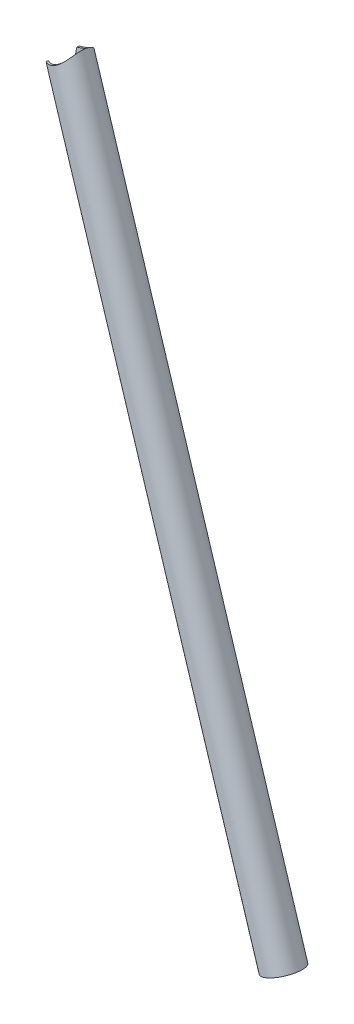
ISO-10303-21;
HEADER;
FILE_DESCRIPTION(('STEP AP214'),'2;1');
FILE_NAME('part.step','',(''),(''),'','','');
FILE_SCHEMA(('AUTOMOTIVE_DESIGN { 1 0 10303 214 1 1 1 1 }'));
ENDSEC;
DATA;
#1=APPLICATION_CONTEXT('core data for automotive mechanical design processes');
#2=APPLICATION_PROTOCOL_DEFINITION('international standard','automotive_design',2000,#1);
#3=PRODUCT_CONTEXT('',#1,'mechanical');
#4=PRODUCT('Part','Part','',(#3));
#5=PRODUCT_RELATED_PRODUCT_CATEGORY('part','',(#4));
#6=PRODUCT_DEFINITION_FORMATION('','',#4);
#7=PRODUCT_DEFINITION_CONTEXT('part definition',#1,'design');
#8=PRODUCT_DEFINITION('design','',#6,#7);
#9=PRODUCT_DEFINITION_SHAPE('','',#8);
#10=(LENGTH_UNIT() NAMED_UNIT(*) SI_UNIT(.MILLI.,.METRE.));
#11=(NAMED_UNIT(*) PLANE_ANGLE_UNIT() SI_UNIT($,.RADIAN.));
#12=(NAMED_UNIT(*) SI_UNIT($,.STERADIAN.) SOLID_ANGLE_UNIT());
#13=UNCERTAINTY_MEASURE_WITH_UNIT(LENGTH_MEASURE(1.E-05),#10,'distance_accuracy_value','');
#14=(GEOMETRIC_REPRESENTATION_CONTEXT(3) GLOBAL_UNCERTAINTY_ASSIGNED_CONTEXT((#13)) GLOBAL_UNIT_ASSIGNED_CONTEXT((#10,
#11,#12)) REPRESENTATION_CONTEXT('',''));
#15=CARTESIAN_POINT('',(0.,0.,0.));
#16=DIRECTION('',(0.,0.,1.));
#17=DIRECTION('',(1.,0.,0.));
#18=AXIS2_PLACEMENT_3D('',#15,#16,#17);
#19=CARTESIAN_POINT('',(-0.475660045373399,524.183761382044,114.597216694036));
#20=DIRECTION('',(-0.0599256750075872,0.0388990717535077,0.997444622869661));
#21=DIRECTION('',(-0.732310027678345,-0.680747809489739,-0.0174483018275184));
#22=AXIS2_PLACEMENT_3D('',#19,#20,#21);
#23=CYLINDRICAL_SURFACE('',#22,11.1125);
#24=CARTESIAN_POINT('',(10.2341303943395,519.556049376738,107.13314314926));
#25=CARTESIAN_POINT('',(10.2274072117825,519.573100332418,107.314965218978));
#26=CARTESIAN_POINT('',(10.217147495631,519.581911336864,107.497503596553));
#27=CARTESIAN_POINT('',(10.1896538638208,519.582872489982,107.862184967526));
#28=CARTESIAN_POINT('',(10.172414933988,519.575010642896,108.044327581803));
#29=CARTESIAN_POINT('',(10.1310443711813,519.543174120642,108.406828407419));
#30=CARTESIAN_POINT('',(10.1068970689237,519.519162646377,108.587181586754));
#31=CARTESIAN_POINT('',(10.0518550196694,519.456214461605,108.944252514454));
#32=CARTESIAN_POINT('',(10.0209565952736,519.417269607985,109.120968223825));
#33=CARTESIAN_POINT('',(9.91909959923639,519.281475935115,109.639728696333));
#34=CARTESIAN_POINT('',(9.83846253316572,519.165199254636,109.974913811905));
#35=CARTESIAN_POINT('',(9.6514691814672,518.894014049779,110.621253297568));
#36=CARTESIAN_POINT('',(9.54509706134565,518.739081739179,110.93239271649));
#37=CARTESIAN_POINT('',(9.34051081738401,518.450992682181,111.442640685805));
#38=CARTESIAN_POINT('',(9.24878846216203,518.324438580501,111.648183754764));
#39=CARTESIAN_POINT('',(9.05151799896422,518.061095013442,112.045750049925));
#40=CARTESIAN_POINT('',(8.94596542544548,517.924302248315,112.237768878458));
#41=CARTESIAN_POINT('',(8.72040709027281,517.643312205219,112.607877700326));
#42=CARTESIAN_POINT('',(8.60038073665043,517.499104549272,112.785947239759));
#43=CARTESIAN_POINT('',(8.34549137645246,517.206116965066,113.127048694065));
#44=CARTESIAN_POINT('',(8.21063009397951,517.057337569575,113.290082352356));
#45=CARTESIAN_POINT('',(7.92485533927849,516.75685628955,113.600893131238));
#46=CARTESIAN_POINT('',(7.77386056846067,516.605143094095,113.748584800673));
#47=CARTESIAN_POINT('',(7.45610250048303,516.301994742729,114.026360756286));
#48=CARTESIAN_POINT('',(7.28933755542274,516.150559617564,114.156443198932));
#49=CARTESIAN_POINT('',(6.9404603608249,515.850822091455,114.397066891145));
#50=CARTESIAN_POINT('',(6.75838387600943,515.702513349384,114.507651907774));
#51=CARTESIAN_POINT('',(6.37903305540815,515.411282149353,114.707799073185));
#52=CARTESIAN_POINT('',(6.18176519311311,515.268357435344,114.797370111514));
#53=CARTESIAN_POINT('',(5.82877955569832,515.028388699874,114.932376890613));
#54=CARTESIAN_POINT('',(5.67638208366133,514.929452491543,114.983188692357));
#55=CARTESIAN_POINT('',(5.36472506317856,514.736829174619,115.072076648534));
#56=CARTESIAN_POINT('',(5.20546701110686,514.643140931535,115.110155564443));
#57=CARTESIAN_POINT('',(4.88098021012821,514.462022743711,115.173005288141));
#58=CARTESIAN_POINT('',(4.71575449392061,514.374589685664,115.197782756778));
#59=CARTESIAN_POINT('',(4.38027288138449,514.206819065646,115.23364268118));
#60=CARTESIAN_POINT('',(4.21001681390169,514.126481745475,115.244724670416));
#61=CARTESIAN_POINT('',(3.86529205265225,513.973506100937,115.25296874534));
#62=CARTESIAN_POINT('',(3.69081483432062,513.900885291373,115.250099827241));
#63=CARTESIAN_POINT('',(3.33933866029077,513.76415308406,115.23035272871));
#64=CARTESIAN_POINT('',(3.16233971400731,513.700041654552,115.213474600568));
#65=CARTESIAN_POINT('',(2.80716968054416,513.580720861931,115.165907293643));
#66=CARTESIAN_POINT('',(2.62899838098968,513.525513160695,115.135215540598));
#67=CARTESIAN_POINT('',(2.27289102468856,513.424202505232,115.060425592442));
#68=CARTESIAN_POINT('',(2.09495496717308,513.378099521174,115.016327441257));
#69=CARTESIAN_POINT('',(1.74580106188308,513.296188052865,114.916772870867));
#70=CARTESIAN_POINT('',(1.57453871145066,513.260118374425,114.86168553708));
#71=CARTESIAN_POINT('',(1.23450294724859,513.196328566987,114.740024743629));
#72=CARTESIAN_POINT('',(1.06573042547763,513.1686113644,114.673447271045));
#73=CARTESIAN_POINT('',(0.731746957375261,513.121209696467,114.5295222931));
#74=CARTESIAN_POINT('',(0.566535075553879,513.101523096254,114.452177657442));
#75=CARTESIAN_POINT('',(0.240444534504744,513.069703940657,114.28740384819));
#76=CARTESIAN_POINT('',(0.0795674722509791,513.0575741338,114.199971019047));
#77=CARTESIAN_POINT('',(-0.429754003328394,513.029871524286,113.903593727653));
#78=CARTESIAN_POINT('',(-0.768421976588896,513.028044844768,113.676163686224));
#79=CARTESIAN_POINT('',(-1.41452239493937,513.051992837081,113.181716656374));
#80=CARTESIAN_POINT('',(-1.72192338262479,513.077795011062,112.914660451655));
#81=CARTESIAN_POINT('',(-2.18221920858475,513.134416955797,112.46208290388));
#82=CARTESIAN_POINT('',(-2.34702829566076,513.158907131197,112.28768408927));
#83=CARTESIAN_POINT('',(-2.66282531291183,513.2129222477,111.927421055171));
#84=CARTESIAN_POINT('',(-2.81381051262176,513.242448180171,111.741554582697));
#85=CARTESIAN_POINT('',(-3.10069278605441,513.304560378944,111.35892835691));
#86=CARTESIAN_POINT('',(-3.23658752838108,513.337147116692,111.162166927402));
#87=CARTESIAN_POINT('',(-3.49169450253777,513.403160339882,110.758382399945));
#88=CARTESIAN_POINT('',(-3.61091116576239,513.436586599467,110.551362047683));
#89=CARTESIAN_POINT('',(-3.89328254533656,513.520380518163,110.007089887458));
#90=CARTESIAN_POINT('',(-4.04311416779491,513.569628647218,109.662447583355));
#91=CARTESIAN_POINT('',(-4.22677793942232,513.632496703588,109.130598112818));
#92=CARTESIAN_POINT('',(-4.28113163433348,513.651610537148,108.950946027161));
#93=CARTESIAN_POINT('',(-4.3749830692836,513.684816285076,108.587295408968));
#94=CARTESIAN_POINT('',(-4.41448355467281,513.698909127458,108.403297686335));
#95=CARTESIAN_POINT('',(-4.47265473249613,513.719153799665,108.060239400771));
#96=CARTESIAN_POINT('',(-4.49357026437961,513.72618347068,107.901609317209));
#97=CARTESIAN_POINT('',(-4.52322061415148,513.735096933993,107.583078597964));
#98=CARTESIAN_POINT('',(-4.53195774497786,513.736981703483,107.423178209343));
#99=CARTESIAN_POINT('',(-4.53688026160235,513.735218559291,107.10329509949));
#100=CARTESIAN_POINT('',(-4.53307245079007,513.731573645053,106.943312469914));
#101=CARTESIAN_POINT('',(-4.51284554028126,513.718660510578,106.624370285301));
#102=CARTESIAN_POINT('',(-4.49642610986406,513.709392142876,106.465410757203));
#103=CARTESIAN_POINT('',(-4.45126104064574,513.685468604504,106.149976516807));
#104=CARTESIAN_POINT('',(-4.42253841751851,513.67082349941,105.99349772778));
#105=CARTESIAN_POINT('',(-4.35329175473335,513.636634735789,105.683736567292));
#106=CARTESIAN_POINT('',(-4.3127677713199,513.617091100609,105.530454180602));
#107=CARTESIAN_POINT('',(-4.2205775792786,513.573775487583,105.227704982746));
#108=CARTESIAN_POINT('',(-4.16889820857593,513.549998520748,105.078242914123));
#109=CARTESIAN_POINT('',(-4.05523398016214,513.499049919579,104.783872513099));
#110=CARTESIAN_POINT('',(-3.99324649859177,513.471877421373,104.638965351314));
#111=CARTESIAN_POINT('',(-3.83276722936407,513.403490451262,104.296400759623));
#112=CARTESIAN_POINT('',(-3.72965769538993,513.361045368198,104.10114315699));
#113=CARTESIAN_POINT('',(-3.50692369786928,513.273568905556,103.720996867305));
#114=CARTESIAN_POINT('',(-3.38729936067065,513.228537545766,103.536108100941));
#115=CARTESIAN_POINT('',(-3.13313668638354,513.138005087593,103.176528588132));
#116=CARTESIAN_POINT('',(-2.99857231262977,513.092503298559,103.001856481648));
#117=CARTESIAN_POINT('',(-2.71623893171839,513.003108085996,102.663157775538));
#118=CARTESIAN_POINT('',(-2.56847126674365,512.959214499625,102.499130096772));
#119=CARTESIAN_POINT('',(-2.25690127896265,512.873711980385,102.177597271798));
#120=CARTESIAN_POINT('',(-2.09277874633396,512.832193889067,102.0203784255));
#121=CARTESIAN_POINT('',(-1.75300423607653,512.754501036428,101.717399306595));
#122=CARTESIAN_POINT('',(-1.57734893927496,512.718327823207,101.571642359525));
#123=CARTESIAN_POINT('',(-1.21574699319488,512.653022194708,101.292160439675));
#124=CARTESIAN_POINT('',(-1.02981065763395,512.623882875207,101.15842374985));
#125=CARTESIAN_POINT('',(-0.648483372154977,512.574157863867,100.903397298334));
#126=CARTESIAN_POINT('',(-0.453092791316318,512.55357183842,100.782107051329));
#127=CARTESIAN_POINT('',(-0.0675466143273456,512.523497877058,100.560565603574));
#128=CARTESIAN_POINT('',(0.122056415386738,512.513348498664,100.459443525601));
#129=CARTESIAN_POINT('',(0.507495605876689,512.502897747924,100.269453894657));
#130=CARTESIAN_POINT('',(0.703329085371902,512.502592195158,100.180581155674));
#131=CARTESIAN_POINT('',(1.10016107835525,512.512864593116,100.015888428465));
#132=CARTESIAN_POINT('',(1.30115967348481,512.523442715973,99.9400686467042));
#133=CARTESIAN_POINT('',(1.70696063690539,512.556396345449,99.8023865639658));
#134=CARTESIAN_POINT('',(1.91176298629878,512.578771793472,99.7405241936652));
#135=CARTESIAN_POINT('',(2.32520625443408,512.636268913058,99.6312204898819));
#136=CARTESIAN_POINT('',(2.53386471044798,512.671489766273,99.5838967979741));
#137=CARTESIAN_POINT('',(2.95156673790204,512.755121795286,99.5051592657375));
#138=CARTESIAN_POINT('',(3.16061031343804,512.803533112181,99.4737455956078));
#139=CARTESIAN_POINT('',(3.57687186890562,512.913633976981,99.4274852891521));
#140=CARTESIAN_POINT('',(3.7840911052842,512.975313496249,99.4126261923473));
#141=CARTESIAN_POINT('',(4.19471448402494,513.111713757701,99.3998072917349));
#142=CARTESIAN_POINT('',(4.39811914938704,513.18643269741,99.4018451540252));
#143=CARTESIAN_POINT('',(4.77234310442548,513.337477618081,99.4214566568617));
#144=CARTESIAN_POINT('',(4.94389805659461,513.412267992186,99.4369278661369));
#145=CARTESIAN_POINT('',(5.28133085412802,513.570505707208,99.4804206544552));
#146=CARTESIAN_POINT('',(5.4472087805626,513.653952924432,99.5084420541958));
#147=CARTESIAN_POINT('',(5.77217414116783,513.82868424282,99.5766871404416));
#148=CARTESIAN_POINT('',(5.93126161281632,513.919968300723,99.6169107595904));
#149=CARTESIAN_POINT('',(6.24174386927863,514.109433012722,99.7090680992979));
#150=CARTESIAN_POINT('',(6.39313838235479,514.207613910143,99.7610022331542));
#151=CARTESIAN_POINT('',(6.68616068945117,514.408911474504,99.875454607113));
#152=CARTESIAN_POINT('',(6.82786643169186,514.511973540804,99.9378695709405));
#153=CARTESIAN_POINT('',(7.10259155337179,514.722853870142,100.072987247444));
#154=CARTESIAN_POINT('',(7.23560807226988,514.830673680079,100.145693323316));
#155=CARTESIAN_POINT('',(7.62104021040224,515.159663632023,100.378249430149));
#156=CARTESIAN_POINT('',(7.86005118604512,515.386512692556,100.552621849205));
#157=CARTESIAN_POINT('',(8.33149021548269,515.878625910989,100.961267156772));
#158=CARTESIAN_POINT('',(8.55852684715895,516.144894032543,101.200474212741));
#159=CARTESIAN_POINT('',(8.96698988478807,516.675789068417,101.717501913532));
#160=CARTESIAN_POINT('',(9.1483492727932,516.940413021973,101.995378377651));
#161=CARTESIAN_POINT('',(9.40220225351772,517.35066733785,102.465252580887));
#162=CARTESIAN_POINT('',(9.48889738598124,517.500732640374,102.6459393355));
#163=CARTESIAN_POINT('',(9.64765435916807,517.793658094003,103.019356179307));
#164=CARTESIAN_POINT('',(9.71971235962315,517.936516346862,103.212089411772));
#165=CARTESIAN_POINT('',(9.84957312766494,518.211927996309,103.609225419299));
#166=CARTESIAN_POINT('',(9.90738279842578,518.344486361689,103.813622484002));
#167=CARTESIAN_POINT('',(10.0091407913996,518.595874061277,104.233947215154));
#168=CARTESIAN_POINT('',(10.0530960887492,518.714710284891,104.449869015112));
#169=CARTESIAN_POINT('',(10.1166382950002,518.902765917957,104.82862281537));
#170=CARTESIAN_POINT('',(10.139595752083,518.976386249183,104.988714919477));
#171=CARTESIAN_POINT('',(10.1786977969855,519.113066486238,105.314136268454));
#172=CARTESIAN_POINT('',(10.1948445423874,519.176129732648,105.479463836897));
#173=CARTESIAN_POINT('',(10.2203169051271,519.289889792675,105.8142222992));
#174=CARTESIAN_POINT('',(10.2296654576585,519.340627798664,105.98363738506));
#175=CARTESIAN_POINT('',(10.2416465276669,519.428471874124,106.32613498641));
#176=CARTESIAN_POINT('',(10.2442836932802,519.465587362951,106.499214879934));
#177=CARTESIAN_POINT('',(10.2432826379168,519.508294206217,106.749696803824));
#178=CARTESIAN_POINT('',(10.2423407030296,519.519871847071,106.826130206125));
#179=CARTESIAN_POINT('',(10.2391874121701,519.540142068033,106.97938060579));
#180=CARTESIAN_POINT('',(10.236975582846,519.548833570428,107.056197735598));
#181=CARTESIAN_POINT('',(10.2341303943395,519.556049376738,107.13314314926));
#182=B_SPLINE_CURVE_WITH_KNOTS('',3,(#24,#25,#26,#27,#28,#29,#30,#31,#32,#33,#34,#35,#36,#37,
#38,#39,#40,#41,#42,#43,#44,#45,#46,#47,#48,#49,#50,#51,#52,#53,#54,#55,#56,#57,#58,#59,#60,#61,
#62,#63,#64,#65,#66,#67,#68,#69,#70,#71,#72,#73,#74,#75,#76,#77,#78,#79,#80,#81,#82,#83,#84,#85,
#86,#87,#88,#89,#90,#91,#92,#93,#94,#95,#96,#97,#98,#99,#100,#101,#102,#103,#104,#105,#106,#107,
#108,#109,#110,#111,#112,#113,#114,#115,#116,#117,#118,#119,#120,#121,#122,#123,#124,#125,#126,
#127,#128,#129,#130,#131,#132,#133,#134,#135,#136,#137,#138,#139,#140,#141,#142,#143,#144,#145,
#146,#147,#148,#149,#150,#151,#152,#153,#154,#155,#156,#157,#158,#159,#160,#161,#162,#163,#164,
#165,#166,#167,#168,#169,#170,#171,#172,#173,#174,#175,#176,#177,#178,#179,#180,#181),
.UNSPECIFIED.,.T.,.F.,(4,2,2,2,2,2,2,2,2,2,2,2,2,2,2,2,2,2,2,2,2,2,2,2,2,2,2,2,2,2,2,2,2,2,2,2,
2,2,2,2,2,2,2,2,2,2,2,2,2,2,2,2,2,2,2,2,2,2,2,2,2,2,2,2,2,2,2,2,2,2,2,2,2,2,2,2,2,2,4),(0.,
0.548131685017418,1.09665787277749,1.64643820485618,2.196518757315,3.2831275482416,
4.37040662549944,5.1441740946513,5.91819201870665,6.69332443291498,7.46836685689005,
8.24751754832977,9.02674974708444,9.80420984614681,10.5813404606877,11.1467698004782,
11.7120764317163,12.2770997146501,12.8421422443048,13.4084410688968,13.9747377797962,
14.5411400676258,15.1075404996766,15.6574091879198,16.2074703072733,16.7573851020379,
17.3074997930231,18.5264904887493,19.7466957138546,20.469652674001,21.1927521244106,
21.9159631348981,22.6389816205128,23.771230623246,24.3366780369666,24.9020208864098,
25.3819848148533,25.8618575754886,26.3414701337328,26.8210952695216,27.2998270588399,
27.7785565665924,28.2578540380861,28.7372736987515,29.4108233649177,30.0843678783218,
30.7591052003001,31.4337740096043,32.12624449019,32.8189151474861,33.5109031132884,
34.2028640866922,34.8476080021122,35.4920781077808,36.1365584064167,36.781035504032,
37.4305978830646,38.0801672107017,38.7292472823167,39.3782377008703,39.9409073473895,
40.5035689553937,41.0662274575573,41.6289058206594,42.1863341143731,42.7439450013157,
43.8583565792215,45.1254976553122,46.3944871983125,47.1448916332729,47.8954926943727,
48.6457293786935,49.3955877425332,49.9282273546744,50.4606981036301,50.9913640044802,
51.5216622794491,51.7535400367568,51.9855042824093),.UNSPECIFIED.);
#183=CARTESIAN_POINT('',(0.845729685967278,512.506421026561,100.121684494328));
#184=VERTEX_POINT('',#183);
#185=CARTESIAN_POINT('',(0.00263960369813285,513.053689315165,114.154662329748));
#186=VERTEX_POINT('',#185);
#187=EDGE_CURVE('E83',#184,#186,#182,.T.);
#188=ORIENTED_EDGE('',*,*,#187,.F.);
#189=DIRECTION('',(-0.0599256750075872,0.0388990717535077,0.997444622869661));
#190=VECTOR('',#189,1.);
#191=CARTESIAN_POINT('',(-0.0514754005405243,513.088816552907,115.055390106074));
#192=LINE('',#191,#190);
#193=CARTESIAN_POINT('',(0.784542491362576,512.546138978391,101.140126726964));
#194=VERTEX_POINT('',#193);
#195=EDGE_CURVE('E77',#184,#194,#192,.T.);
#196=ORIENTED_EDGE('',*,*,#195,.T.);
#197=CARTESIAN_POINT('',(9.70428448517733,518.475961128007,107.180409164478));
#198=CARTESIAN_POINT('',(9.69852402599452,518.490585941782,107.350302365884));
#199=CARTESIAN_POINT('',(9.68884714249733,518.4982310049,107.520631659068));
#200=CARTESIAN_POINT('',(9.66174681752716,518.499503286333,107.860781957199));
#201=CARTESIAN_POINT('',(9.64432142780684,518.49312697759,108.030602823491));
#202=CARTESIAN_POINT('',(9.60183658965247,518.466746187641,108.368373854521));
#203=CARTESIAN_POINT('',(9.57676952416774,518.446728083892,108.536321978616));
#204=CARTESIAN_POINT('',(9.51915592951392,518.393902960578,108.868953469232));
#205=CARTESIAN_POINT('',(9.48660587379771,518.36108990598,109.033635256534));
#206=CARTESIAN_POINT('',(9.41448399485506,518.284155401581,109.357264060771));
#207=CARTESIAN_POINT('',(9.37497145691882,518.240128131366,109.516246835398));
#208=CARTESIAN_POINT('',(9.2888675096423,518.141925231741,109.829105180273));
#209=CARTESIAN_POINT('',(9.24227331027489,518.087745600546,109.982978708343));
#210=CARTESIAN_POINT('',(9.09202570386455,517.912012929089,110.435897080653));
#211=CARTESIAN_POINT('',(8.9778654903417,517.777218695848,110.726427873167));
#212=CARTESIAN_POINT('',(8.70618747819058,517.464657643365,111.314770610721));
#213=CARTESIAN_POINT('',(8.54509291253079,517.283663401642,111.609202214364));
#214=CARTESIAN_POINT('',(8.27683164536406,516.997705497105,112.02334347716));
#215=CARTESIAN_POINT('',(8.18290139736027,516.899903366229,112.156887983856));
#216=CARTESIAN_POINT('',(7.98597529629124,516.700726497281,112.414390983337));
#217=CARTESIAN_POINT('',(7.88297761145332,516.599351039829,112.538347529649));
#218=CARTESIAN_POINT('',(7.65007945963047,516.377415166248,112.795703660117));
#219=CARTESIAN_POINT('',(7.51854502201384,516.256450941933,112.927282742327));
#220=CARTESIAN_POINT('',(7.24307605200157,516.013477991662,113.175532938972));
#221=CARTESIAN_POINT('',(7.09914641571891,515.891469695111,113.292209894947));
#222=CARTESIAN_POINT('',(6.79897086467986,515.648314533129,113.509539084957));
#223=CARTESIAN_POINT('',(6.64272585534105,515.527167605084,113.61019249539));
#224=CARTESIAN_POINT('',(6.31831697593359,515.287706129889,113.794187712662));
#225=CARTESIAN_POINT('',(6.15015483145522,515.169391175978,113.877532019002));
#226=CARTESIAN_POINT('',(5.81502370943682,514.945813896566,114.020338161307));
#227=CARTESIAN_POINT('',(5.6488196371723,514.840221577125,114.081076529646));
#228=CARTESIAN_POINT('',(5.30771931034792,514.634753466488,114.185499029512));
#229=CARTESIAN_POINT('',(5.13282333990288,514.534877488671,114.229183718067));
#230=CARTESIAN_POINT('',(4.7758526258984,514.342451907358,114.298624117688));
#231=CARTESIAN_POINT('',(4.5937864566691,514.249893928799,114.324400594883));
#232=CARTESIAN_POINT('',(4.2239348529842,514.073319089809,114.357529746721));
#233=CARTESIAN_POINT('',(4.03615035192708,513.989300845053,114.364885412034));
#234=CARTESIAN_POINT('',(3.68523731225424,513.842768043616,114.361252625633));
#235=CARTESIAN_POINT('',(3.52263299805859,513.778918048703,114.352848998301));
#236=CARTESIAN_POINT('',(3.19592930406396,513.65864302955,114.322653307837));
#237=CARTESIAN_POINT('',(3.03182998642782,513.602217698082,114.300861798898));
#238=CARTESIAN_POINT('',(2.70344447742197,513.497093107185,114.244158102465));
#239=CARTESIAN_POINT('',(2.53915829835466,513.448393365775,114.209246733946));
#240=CARTESIAN_POINT('',(2.21164858848721,513.35881134238,114.126740961333));
#241=CARTESIAN_POINT('',(2.04842508549249,513.317929264161,114.079146226728));
#242=CARTESIAN_POINT('',(1.72892060747086,513.244967124713,113.973391426255));
#243=CARTESIAN_POINT('',(1.57257536886612,513.212666702382,113.915576714683));
#244=CARTESIAN_POINT('',(1.26298039391839,513.155111855459,113.789119406575));
#245=CARTESIAN_POINT('',(1.10973167974795,513.12985972339,113.720473298363));
#246=CARTESIAN_POINT('',(0.656093139874496,513.064196421156,113.499263508185));
#247=CARTESIAN_POINT('',(0.361571120532479,513.033825138313,113.331348082877));
#248=CARTESIAN_POINT('',(-0.236482110479328,512.993927596258,112.939455879444));
#249=CARTESIAN_POINT('',(-0.537448468208959,512.987057905747,112.711346825453));
#250=CARTESIAN_POINT('',(-1.10629947565531,512.994665273246,112.216729779439));
#251=CARTESIAN_POINT('',(-1.37414295334735,513.009168614694,111.950174872528));
#252=CARTESIAN_POINT('',(-1.76438786421146,513.042591483665,111.504457114132));
#253=CARTESIAN_POINT('',(-1.90013584866818,513.056996776036,111.336446324732));
#254=CARTESIAN_POINT('',(-2.15738091160013,513.088594053643,110.990086995496));
#255=CARTESIAN_POINT('',(-2.27887539294782,513.105786545378,110.811736580497));
#256=CARTESIAN_POINT('',(-2.61964140816113,513.158937188459,110.262487087379));
#257=CARTESIAN_POINT('',(-2.81574639947498,513.196527702524,109.876767615727));
#258=CARTESIAN_POINT('',(-3.09481958250314,513.253258518596,109.166978944238));
#259=CARTESIAN_POINT('',(-3.19346315152599,513.274655197558,108.849277538477));
#260=CARTESIAN_POINT('',(-3.30224978880484,513.296781358843,108.363812495905));
#261=CARTESIAN_POINT('',(-3.33197878048745,513.302495021095,108.200561985427));
#262=CARTESIAN_POINT('',(-3.37772572611929,513.309957542069,107.872021538686));
#263=CARTESIAN_POINT('',(-3.39374368811382,513.311706403118,107.70673160362));
#264=CARTESIAN_POINT('',(-3.41158978403247,513.31075912102,107.374515850324));
#265=CARTESIAN_POINT('',(-3.41334235653223,513.308039399634,107.20758600415));
#266=CARTESIAN_POINT('',(-3.40225763869407,513.297914425699,106.874350051432));
#267=CARTESIAN_POINT('',(-3.38942038017636,513.290509183369,106.708043943529));
#268=CARTESIAN_POINT('',(-3.34930171200665,513.271124931376,106.377386225035));
#269=CARTESIAN_POINT('',(-3.32201400009135,513.259143926726,106.213035499245));
#270=CARTESIAN_POINT('',(-3.25348632902298,513.231025006105,105.88764559627));
#271=CARTESIAN_POINT('',(-3.21224641605312,513.214887103894,105.726606408126));
#272=CARTESIAN_POINT('',(-3.11992879546742,513.180369158243,105.420061626706));
#273=CARTESIAN_POINT('',(-3.06974391944994,513.162225749008,105.274258724306));
#274=CARTESIAN_POINT('',(-2.95868850868236,513.123570700371,104.987081269528));
#275=CARTESIAN_POINT('',(-2.89781441333712,513.103058272626,104.845708211289));
#276=CARTESIAN_POINT('',(-2.70034063661447,513.039056877131,104.429094278118));
#277=CARTESIAN_POINT('',(-2.54884219482633,512.993085256175,104.161205673378));
#278=CARTESIAN_POINT('',(-2.18517194114654,512.893133255108,103.606629825929));
#279=CARTESIAN_POINT('',(-1.9671687506607,512.839049449503,103.323803753242));
#280=CARTESIAN_POINT('',(-1.61204671820642,512.763876303966,102.923655334881));
#281=CARTESIAN_POINT('',(-1.48887951656227,512.739794240791,102.794196165249));
#282=CARTESIAN_POINT('',(-1.23386932674284,512.694594236527,102.543480717771));
#283=CARTESIAN_POINT('',(-1.1020248949766,512.673476790488,102.422225811671));
#284=CARTESIAN_POINT('',(-0.803048711308197,512.631310385436,102.164635001193));
#285=CARTESIAN_POINT('',(-0.634162016973729,512.611133733879,102.030187796773));
#286=CARTESIAN_POINT('',(-0.286261482586749,512.578028231156,101.774211403674));
#287=CARTESIAN_POINT('',(-0.107250465108008,512.565097370787,101.652678641497));
#288=CARTESIAN_POINT('',(0.259653954114896,512.547950349292,101.423249052663));
#289=CARTESIAN_POINT('',(0.447544868871461,512.543731762748,101.315348438792));
#290=CARTESIAN_POINT('',(0.830882283512546,512.545376043955,101.114039932458));
#291=CARTESIAN_POINT('',(1.02632710915892,512.551236690144,101.020628851303));
#292=CARTESIAN_POINT('',(1.39063769269737,512.572370908978,100.863353519791));
#293=CARTESIAN_POINT('',(1.55859820418272,512.585940861551,100.797156196248));
#294=CARTESIAN_POINT('',(1.89768767748597,512.621587031694,100.676181696218));
#295=CARTESIAN_POINT('',(2.06881604947579,512.64366168063,100.621402416619));
#296=CARTESIAN_POINT('',(2.41299943300873,512.696786153223,100.523883191754));
#297=CARTESIAN_POINT('',(2.58605323952833,512.72783063691,100.481136113218));
#298=CARTESIAN_POINT('',(2.93290174378721,512.799216289923,100.40818272871));
#299=CARTESIAN_POINT('',(3.10669644972339,512.839557562367,100.377976561851));
#300=CARTESIAN_POINT('',(3.45439374642533,512.929848921924,100.330444595417));
#301=CARTESIAN_POINT('',(3.62829343697403,512.979840573446,100.313176148913));
#302=CARTESIAN_POINT('',(3.97395374254662,513.089199217477,100.292036380308));
#303=CARTESIAN_POINT('',(4.1457143521953,513.14856623354,100.288165091865));
#304=CARTESIAN_POINT('',(4.48560712457358,513.276306929637,100.293928408852));
#305=CARTESIAN_POINT('',(4.65373957367536,513.344679895779,100.30356194435));
#306=CARTESIAN_POINT('',(4.98498639575774,513.489838167102,100.336238351177));
#307=CARTESIAN_POINT('',(5.14810100484538,513.566623075692,100.35928059056));
#308=CARTESIAN_POINT('',(5.45636344402139,513.721910814192,100.416314218753));
#309=CARTESIAN_POINT('',(5.60195338161804,513.799878541895,100.44938296616));
#310=CARTESIAN_POINT('',(5.88694741841346,513.96162130851,100.526436808482));
#311=CARTESIAN_POINT('',(6.02634939888843,514.045398311712,100.570425608894));
#312=CARTESIAN_POINT('',(6.29817820483402,514.217865600299,100.66884040159));
#313=CARTESIAN_POINT('',(6.4306072220701,514.306554323613,100.723263088995));
#314=CARTESIAN_POINT('',(6.68806518190723,514.488012892324,100.842058107929));
#315=CARTESIAN_POINT('',(6.81309121666177,514.580784316765,100.906434313754));
#316=CARTESIAN_POINT('',(7.06164987652707,514.774395369787,101.048187593977));
#317=CARTESIAN_POINT('',(7.18476453157442,514.875403444752,101.126067612863));
#318=CARTESIAN_POINT('',(7.42210717842839,515.079850538526,101.29161210464));
#319=CARTESIAN_POINT('',(7.53633211241967,515.183290378002,101.379279919235));
#320=CARTESIAN_POINT('',(7.86546133365889,515.49568176551,101.656079318261));
#321=CARTESIAN_POINT('',(8.06689535365722,515.706764928841,101.859050393689));
#322=CARTESIAN_POINT('',(8.46056114638255,516.156787877162,102.329801811829));
#323=CARTESIAN_POINT('',(8.6471533070998,516.395294129766,102.602717964581));
#324=CARTESIAN_POINT('',(8.89264082983038,516.74048514615,103.040982302412));
#325=CARTESIAN_POINT('',(8.96877975748946,516.853532410443,103.192006870598));
#326=CARTESIAN_POINT('',(9.10978873954592,517.073677375143,103.503350365038));
#327=CARTESIAN_POINT('',(9.1746585124964,517.18077492691,103.663669523289));
#328=CARTESIAN_POINT('',(9.34337399604702,517.474308515708,104.132584792581));
#329=CARTESIAN_POINT('',(9.43394620465168,517.651474153456,104.452194712422));
#330=CARTESIAN_POINT('',(9.54150956615224,517.886513017613,104.951346391274));
#331=CARTESIAN_POINT('',(9.57263617044708,517.959700149793,105.120893009427));
#332=CARTESIAN_POINT('',(9.62552453669555,518.094123719053,105.466063083853));
#333=CARTESIAN_POINT('',(9.64729008749262,518.155364985673,105.641684050406));
#334=CARTESIAN_POINT('',(9.68547991475384,518.277062988604,106.040584696777));
#335=CARTESIAN_POINT('',(9.69939419579058,518.333852835204,106.265245791163));
#336=CARTESIAN_POINT('',(9.71270730360687,518.423371599165,106.71980642466));
#337=CARTESIAN_POINT('',(9.7121067979634,518.456101623035,106.949705722364));
#338=CARTESIAN_POINT('',(9.70428448517733,518.475961128007,107.180409164478));
#339=B_SPLINE_CURVE_WITH_KNOTS('',3,(#197,#198,#199,#200,#201,#202,#203,#204,#205,#206,#207,
#208,#209,#210,#211,#212,#213,#214,#215,#216,#217,#218,#219,#220,#221,#222,#223,#224,#225,#226,
#227,#228,#229,#230,#231,#232,#233,#234,#235,#236,#237,#238,#239,#240,#241,#242,#243,#244,#245,
#246,#247,#248,#249,#250,#251,#252,#253,#254,#255,#256,#257,#258,#259,#260,#261,#262,#263,#264,
#265,#266,#267,#268,#269,#270,#271,#272,#273,#274,#275,#276,#277,#278,#279,#280,#281,#282,#283,
#284,#285,#286,#287,#288,#289,#290,#291,#292,#293,#294,#295,#296,#297,#298,#299,#300,#301,#302,
#303,#304,#305,#306,#307,#308,#309,#310,#311,#312,#313,#314,#315,#316,#317,#318,#319,#320,#321,
#322,#323,#324,#325,#326,#327,#328,#329,#330,#331,#332,#333,#334,#335,#336,#337,#338),
.UNSPECIFIED.,.T.,.F.,(4,2,2,2,2,2,2,2,2,2,2,2,2,2,2,2,2,2,2,2,2,2,2,2,2,2,2,2,2,2,2,2,2,2,2,2,
2,2,2,2,2,2,2,2,2,2,2,2,2,2,2,2,2,2,2,2,2,2,2,2,2,2,2,2,2,2,2,2,2,2,4),(0.,0.511611877118824,
1.02335246428191,1.53560482013788,2.04809908448078,2.55642358994212,3.06494888631438,
4.08141028136438,5.22098760800446,5.79155605315279,6.36224002825942,7.02715731504481,
7.69181315317954,8.35642017177998,9.02093115175116,9.63820580037208,10.2554602851959,
10.8719978097207,11.4884352311677,12.012456341503,12.5364557613848,13.0604224773268,
13.5844028484459,14.0932297748902,14.6022220096625,15.6194394460313,16.7484075294939,
17.878765117966,18.5275276022442,19.1764081143913,20.4716996358424,21.4674830876334,
21.9650387191125,22.4625940586374,22.9627831632728,23.4629711770048,23.9633775171643,
24.4637822009439,24.9290909345978,25.3945549583405,26.3250042774135,27.4044783698919,
27.9450586921427,28.4857291767149,29.135413532762,29.784917646817,30.4342409203218,
31.0834210948642,31.6260056033059,32.1684900835825,32.7106522722056,33.2528204746693,
33.7973781211845,34.3419371358178,34.8864530097975,35.4309432230758,35.9356642959552,
36.4405568702845,36.9452897859101,37.4502196600411,37.9814838898934,38.512930059449,
39.5755089758835,40.7932605947715,41.4030318501656,42.0128183323952,43.1369195939319,
43.6981776988471,44.2592084228483,44.9539745989464,45.6487088208011),.UNSPECIFIED.);
#340=CARTESIAN_POINT('',(0.0638267983028725,513.013971363335,113.136220097112));
#341=VERTEX_POINT('',#340);
#342=EDGE_CURVE('E76',#194,#341,#339,.T.);
#343=ORIENTED_EDGE('',*,*,#342,.T.);
#344=EDGE_CURVE('E70',#341,#186,#192,.T.);
#345=ORIENTED_EDGE('',*,*,#344,.T.);
#346=EDGE_LOOP('',(#188,#196,#343,#345));
#347=FACE_BOUND('',#346,.T.);
#348=ADVANCED_FACE('F44',(#347),#23,.F.);
#349=CARTESIAN_POINT('',(4.06798199208012,513.554113610895,107.326902546978));
#350=DIRECTION('',(0.366072620209691,-0.928763679559557,0.0582139524839458));
#351=DIRECTION('',(0.930341417771012,0.366694486432266,0.));
#352=AXIS2_PLACEMENT_3D('',#349,#350,#351);
#353=CYLINDRICAL_SURFACE('',#352,7.93750000000001);
#354=CARTESIAN_POINT('',(117.991242352181,224.519149950238,125.443316884713));
#355=DIRECTION('',(-0.366072620209691,0.928763679559558,-0.0582139524839456));
#356=DIRECTION('',(-0.930341417771012,-0.366694486432266,0.));
#357=AXIS2_PLACEMENT_3D('',#354,#355,#356);
#358=CIRCLE('',#357,7.93750000000001);
#359=CARTESIAN_POINT('',(110.606657348624,221.608512464182,125.443316884713));
#360=VERTEX_POINT('',#359);
#361=EDGE_CURVE('E48',#360,#360,#358,.T.);
#362=ORIENTED_EDGE('',*,*,#361,.T.);
#363=EDGE_LOOP('',(#362));
#364=FACE_BOUND('',#363,.T.);
#365=ORIENTED_EDGE('',*,*,#187,.T.);
#366=CARTESIAN_POINT('',(-1.83013326715553E-13,523.875,106.68));
#367=DIRECTION('',(0.997472718226184,0.0405450658339127,0.0583461569513517));
#368=DIRECTION('',(0.0381718465541406,-0.9984202320933,0.041230453276771));
#369=AXIS2_PLACEMENT_3D('',#366,#367,#368);
#370=ELLIPSE('',#369,23.988535495204,7.93750000000001);
#371=EDGE_CURVE('E62',#186,#184,#370,.T.);
#372=ORIENTED_EDGE('',*,*,#371,.T.);
#373=EDGE_LOOP('',(#365,#372));
#374=FACE_BOUND('',#373,.T.);
#375=ADVANCED_FACE('F98',(#364,#374),#353,.T.);
#376=CARTESIAN_POINT('',(4.06798199208012,513.554113610895,107.326902546978));
#377=DIRECTION('',(0.366072620209691,-0.928763679559557,0.0582139524839458));
#378=DIRECTION('',(0.930341417771012,0.366694486432266,0.));
#379=AXIS2_PLACEMENT_3D('',#376,#377,#378);
#380=CYLINDRICAL_SURFACE('',#379,7.0485);
#381=CARTESIAN_POINT('',(117.991242352181,224.519149950239,125.443316884713));
#382=DIRECTION('',(-0.366072620209691,0.928763679559558,-0.0582139524839456));
#383=DIRECTION('',(-0.930341417771012,-0.366694486432266,0.));
#384=AXIS2_PLACEMENT_3D('',#381,#382,#383);
#385=CIRCLE('',#384,7.0485);
#386=CARTESIAN_POINT('',(111.433730869022,221.934503862621,125.443316884713));
#387=VERTEX_POINT('',#386);
#388=EDGE_CURVE('E13',#387,#387,#385,.T.);
#389=ORIENTED_EDGE('',*,*,#388,.F.);
#390=EDGE_LOOP('',(#389));
#391=FACE_BOUND('',#390,.T.);
#392=CARTESIAN_POINT('',(-1.83013326715553E-13,523.875,106.68));
#393=DIRECTION('',(0.997472718226184,0.0405450658339127,0.0583461569513517));
#394=DIRECTION('',(0.0381718465541406,-0.9984202320933,0.041230453276771));
#395=AXIS2_PLACEMENT_3D('',#392,#393,#394);
#396=ELLIPSE('',#395,21.3018195197412,7.0485);
#397=EDGE_CURVE('E54',#341,#194,#396,.T.);
#398=ORIENTED_EDGE('',*,*,#397,.F.);
#399=ORIENTED_EDGE('',*,*,#342,.F.);
#400=EDGE_LOOP('',(#398,#399));
#401=FACE_BOUND('',#400,.T.);
#402=ADVANCED_FACE('F81',(#391,#401),#380,.F.);
#403=CARTESIAN_POINT('',(27.3955028097606,1.11356676195629,1.60247220549749));
#404=DIRECTION('',(0.997472718226184,0.0405450658339127,0.0583461569513517));
#405=DIRECTION('',(0.0583941738534486,0.,-0.998293604336907));
#406=AXIS2_PLACEMENT_3D('',#403,#404,#405);
#407=PLANE('',#406);
#408=ORIENTED_EDGE('',*,*,#344,.F.);
#409=ORIENTED_EDGE('',*,*,#397,.T.);
#410=ORIENTED_EDGE('',*,*,#195,.F.);
#411=ORIENTED_EDGE('',*,*,#371,.F.);
#412=EDGE_LOOP('',(#408,#409,#410,#411));
#413=FACE_BOUND('',#412,.T.);
#414=ADVANCED_FACE('F72',(#413),#407,.F.);
#415=CARTESIAN_POINT('',(117.991242352181,224.519149950238,125.443316884713));
#416=DIRECTION('',(-0.366072620209691,0.928763679559558,-0.0582139524839456));
#417=DIRECTION('',(-0.930341417771012,-0.366694486432266,0.));
#418=AXIS2_PLACEMENT_3D('',#415,#416,#417);
#419=PLANE('',#418);
#420=ORIENTED_EDGE('',*,*,#388,.T.);
#421=EDGE_LOOP('',(#420));
#422=FACE_BOUND('',#421,.T.);
#423=ORIENTED_EDGE('',*,*,#361,.F.);
#424=EDGE_LOOP('',(#423));
#425=FACE_BOUND('',#424,.T.);
#426=ADVANCED_FACE('F46',(#422,#425),#419,.F.);
#427=CLOSED_SHELL('',(#348,#375,#402,#414,#426));
#428=MANIFOLD_SOLID_BREP('B2',#427);
#429=ADVANCED_BREP_SHAPE_REPRESENTATION('',(#18,#428),#14);
#430=SHAPE_DEFINITION_REPRESENTATION(#9,#429);
ENDSEC;
END-ISO-10303-21;
